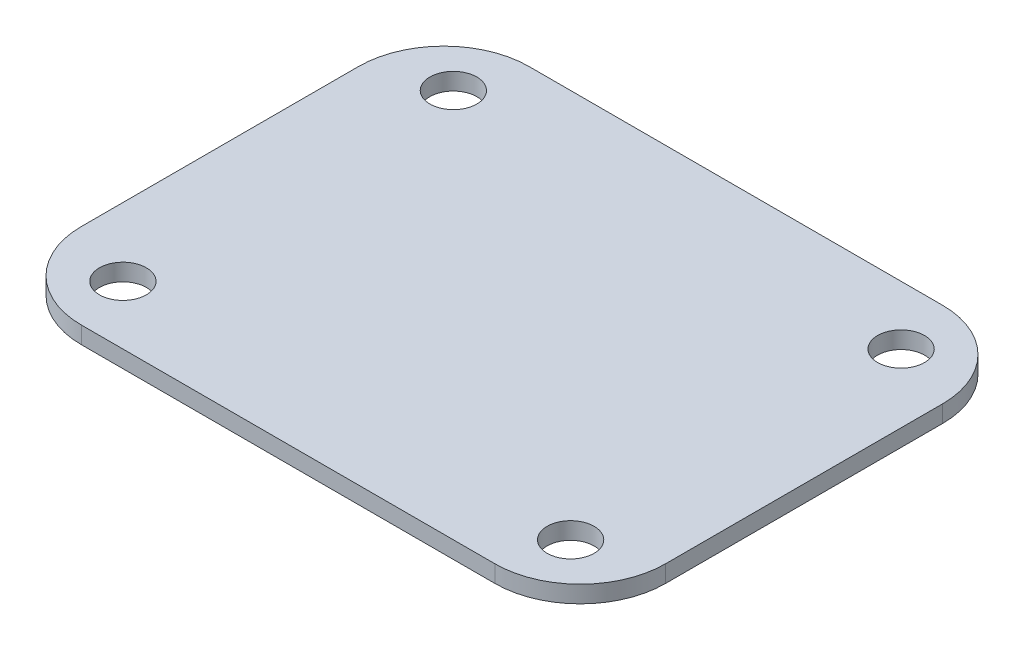
ISO-10303-21;
HEADER;
FILE_DESCRIPTION(('STEP AP214'),'2;1');
FILE_NAME('part.step','',(''),(''),'','','');
FILE_SCHEMA(('AUTOMOTIVE_DESIGN { 1 0 10303 214 1 1 1 1 }'));
ENDSEC;
DATA;
#1=APPLICATION_CONTEXT('core data for automotive mechanical design processes');
#2=APPLICATION_PROTOCOL_DEFINITION('international standard','automotive_design',2000,#1);
#3=PRODUCT_CONTEXT('',#1,'mechanical');
#4=PRODUCT('Part','Part','',(#3));
#5=PRODUCT_RELATED_PRODUCT_CATEGORY('part','',(#4));
#6=PRODUCT_DEFINITION_FORMATION('','',#4);
#7=PRODUCT_DEFINITION_CONTEXT('part definition',#1,'design');
#8=PRODUCT_DEFINITION('design','',#6,#7);
#9=PRODUCT_DEFINITION_SHAPE('','',#8);
#10=(LENGTH_UNIT() NAMED_UNIT(*) SI_UNIT(.MILLI.,.METRE.));
#11=(NAMED_UNIT(*) PLANE_ANGLE_UNIT() SI_UNIT($,.RADIAN.));
#12=(NAMED_UNIT(*) SI_UNIT($,.STERADIAN.) SOLID_ANGLE_UNIT());
#13=UNCERTAINTY_MEASURE_WITH_UNIT(LENGTH_MEASURE(1.E-05),#10,'distance_accuracy_value','');
#14=(GEOMETRIC_REPRESENTATION_CONTEXT(3) GLOBAL_UNCERTAINTY_ASSIGNED_CONTEXT((#13)) GLOBAL_UNIT_ASSIGNED_CONTEXT((#10,
#11,#12)) REPRESENTATION_CONTEXT('',''));
#15=CARTESIAN_POINT('',(0.,0.,0.));
#16=DIRECTION('',(0.,0.,1.));
#17=DIRECTION('',(1.,0.,0.));
#18=AXIS2_PLACEMENT_3D('',#15,#16,#17);
#19=CARTESIAN_POINT('',(-48.5,4.,32.5));
#20=DIRECTION('',(0.,1.,0.));
#21=DIRECTION('',(0.,0.,1.));
#22=AXIS2_PLACEMENT_3D('',#19,#20,#21);
#23=PLANE('',#22);
#24=CARTESIAN_POINT('',(52.5,4.,38.75));
#25=DIRECTION('',(0.,1.,0.));
#26=DIRECTION('',(0.,0.,-1.));
#27=AXIS2_PLACEMENT_3D('',#24,#25,#26);
#28=CIRCLE('',#27,5.5);
#29=CARTESIAN_POINT('',(52.5,4.,33.25));
#30=VERTEX_POINT('',#29);
#31=EDGE_CURVE('E191',#30,#30,#28,.T.);
#32=ORIENTED_EDGE('',*,*,#31,.F.);
#33=EDGE_LOOP('',(#32));
#34=FACE_BOUND('',#33,.T.);
#35=CARTESIAN_POINT('',(52.5,4.,-38.75));
#36=DIRECTION('',(0.,1.,0.));
#37=DIRECTION('',(0.,0.,1.));
#38=AXIS2_PLACEMENT_3D('',#35,#36,#37);
#39=CIRCLE('',#38,5.5);
#40=CARTESIAN_POINT('',(52.5,4.,-33.25));
#41=VERTEX_POINT('',#40);
#42=EDGE_CURVE('E137',#41,#41,#39,.T.);
#43=ORIENTED_EDGE('',*,*,#42,.F.);
#44=EDGE_LOOP('',(#43));
#45=FACE_BOUND('',#44,.T.);
#46=CARTESIAN_POINT('',(-48.5,4.,32.5));
#47=DIRECTION('',(0.,1.,0.));
#48=DIRECTION('',(0.,0.,1.));
#49=AXIS2_PLACEMENT_3D('',#46,#47,#48);
#50=CIRCLE('',#49,20.);
#51=CARTESIAN_POINT('',(-68.5,4.,32.5));
#52=VERTEX_POINT('',#51);
#53=CARTESIAN_POINT('',(-48.5,4.,52.5));
#54=VERTEX_POINT('',#53);
#55=EDGE_CURVE('E148',#52,#54,#50,.T.);
#56=ORIENTED_EDGE('',*,*,#55,.T.);
#57=DIRECTION('',(1.,0.,0.));
#58=VECTOR('',#57,1.);
#59=CARTESIAN_POINT('',(-48.5,4.,52.5));
#60=LINE('',#59,#58);
#61=CARTESIAN_POINT('',(48.5,4.,52.5));
#62=VERTEX_POINT('',#61);
#63=EDGE_CURVE('E96',#54,#62,#60,.T.);
#64=ORIENTED_EDGE('',*,*,#63,.T.);
#65=CARTESIAN_POINT('',(48.5,4.,32.5));
#66=DIRECTION('',(0.,1.,0.));
#67=DIRECTION('',(0.,0.,1.));
#68=AXIS2_PLACEMENT_3D('',#65,#66,#67);
#69=CIRCLE('',#68,20.);
#70=CARTESIAN_POINT('',(68.5,4.,32.5));
#71=VERTEX_POINT('',#70);
#72=EDGE_CURVE('E163',#62,#71,#69,.T.);
#73=ORIENTED_EDGE('',*,*,#72,.T.);
#74=DIRECTION('',(0.,0.,-1.));
#75=VECTOR('',#74,1.);
#76=CARTESIAN_POINT('',(68.5,4.,32.5));
#77=LINE('',#76,#75);
#78=CARTESIAN_POINT('',(68.5,4.,-32.5));
#79=VERTEX_POINT('',#78);
#80=EDGE_CURVE('E176',#71,#79,#77,.T.);
#81=ORIENTED_EDGE('',*,*,#80,.T.);
#82=CARTESIAN_POINT('',(48.5,4.,-32.5));
#83=DIRECTION('',(0.,1.,0.));
#84=DIRECTION('',(0.,0.,1.));
#85=AXIS2_PLACEMENT_3D('',#82,#83,#84);
#86=CIRCLE('',#85,20.);
#87=CARTESIAN_POINT('',(48.5,4.,-52.5));
#88=VERTEX_POINT('',#87);
#89=EDGE_CURVE('E115',#79,#88,#86,.T.);
#90=ORIENTED_EDGE('',*,*,#89,.T.);
#91=DIRECTION('',(-1.,0.,0.));
#92=VECTOR('',#91,1.);
#93=CARTESIAN_POINT('',(48.5,4.,-52.5));
#94=LINE('',#93,#92);
#95=CARTESIAN_POINT('',(-48.5,4.,-52.5));
#96=VERTEX_POINT('',#95);
#97=EDGE_CURVE('E109',#88,#96,#94,.T.);
#98=ORIENTED_EDGE('',*,*,#97,.T.);
#99=CARTESIAN_POINT('',(-48.5,4.,-32.5));
#100=DIRECTION('',(0.,1.,0.));
#101=DIRECTION('',(0.,0.,1.));
#102=AXIS2_PLACEMENT_3D('',#99,#100,#101);
#103=CIRCLE('',#102,20.);
#104=CARTESIAN_POINT('',(-68.5,4.,-32.5));
#105=VERTEX_POINT('',#104);
#106=EDGE_CURVE('E113',#96,#105,#103,.T.);
#107=ORIENTED_EDGE('',*,*,#106,.T.);
#108=DIRECTION('',(0.,0.,1.));
#109=VECTOR('',#108,1.);
#110=CARTESIAN_POINT('',(-68.5,4.,-32.5));
#111=LINE('',#110,#109);
#112=EDGE_CURVE('E53',#105,#52,#111,.T.);
#113=ORIENTED_EDGE('',*,*,#112,.T.);
#114=EDGE_LOOP('',(#56,#64,#73,#81,#90,#98,#107,#113));
#115=FACE_BOUND('',#114,.T.);
#116=CARTESIAN_POINT('',(-52.5,4.,-38.75));
#117=DIRECTION('',(0.,1.,0.));
#118=DIRECTION('',(0.,0.,-1.));
#119=AXIS2_PLACEMENT_3D('',#116,#117,#118);
#120=CIRCLE('',#119,5.5);
#121=CARTESIAN_POINT('',(-52.5,4.,-44.25));
#122=VERTEX_POINT('',#121);
#123=EDGE_CURVE('E185',#122,#122,#120,.T.);
#124=ORIENTED_EDGE('',*,*,#123,.F.);
#125=EDGE_LOOP('',(#124));
#126=FACE_BOUND('',#125,.T.);
#127=CARTESIAN_POINT('',(-52.5,4.,38.75));
#128=DIRECTION('',(0.,1.,0.));
#129=DIRECTION('',(0.,0.,1.));
#130=AXIS2_PLACEMENT_3D('',#127,#128,#129);
#131=CIRCLE('',#130,5.5);
#132=CARTESIAN_POINT('',(-52.5,4.,44.25));
#133=VERTEX_POINT('',#132);
#134=EDGE_CURVE('E197',#133,#133,#131,.T.);
#135=ORIENTED_EDGE('',*,*,#134,.F.);
#136=EDGE_LOOP('',(#135));
#137=FACE_BOUND('',#136,.T.);
#138=ADVANCED_FACE('F36',(#34,#45,#115,#126,#137),#23,.T.);
#139=CARTESIAN_POINT('',(-48.5,0.,32.5));
#140=DIRECTION('',(0.,1.,0.));
#141=DIRECTION('',(0.,0.,1.));
#142=AXIS2_PLACEMENT_3D('',#139,#140,#141);
#143=PLANE('',#142);
#144=CARTESIAN_POINT('',(-48.5,0.,32.5));
#145=DIRECTION('',(0.,1.,0.));
#146=DIRECTION('',(0.,0.,1.));
#147=AXIS2_PLACEMENT_3D('',#144,#145,#146);
#148=CIRCLE('',#147,20.);
#149=CARTESIAN_POINT('',(-68.5,0.,32.5));
#150=VERTEX_POINT('',#149);
#151=CARTESIAN_POINT('',(-48.5,0.,52.5));
#152=VERTEX_POINT('',#151);
#153=EDGE_CURVE('E133',#150,#152,#148,.T.);
#154=ORIENTED_EDGE('',*,*,#153,.F.);
#155=DIRECTION('',(0.,0.,1.));
#156=VECTOR('',#155,1.);
#157=CARTESIAN_POINT('',(-68.5,0.,-32.5));
#158=LINE('',#157,#156);
#159=CARTESIAN_POINT('',(-68.5,0.,-32.5));
#160=VERTEX_POINT('',#159);
#161=EDGE_CURVE('E88',#160,#150,#158,.T.);
#162=ORIENTED_EDGE('',*,*,#161,.F.);
#163=CARTESIAN_POINT('',(-48.5,0.,-32.5));
#164=DIRECTION('',(0.,1.,0.));
#165=DIRECTION('',(0.,0.,1.));
#166=AXIS2_PLACEMENT_3D('',#163,#164,#165);
#167=CIRCLE('',#166,20.);
#168=CARTESIAN_POINT('',(-48.5,0.,-52.5));
#169=VERTEX_POINT('',#168);
#170=EDGE_CURVE('E82',#169,#160,#167,.T.);
#171=ORIENTED_EDGE('',*,*,#170,.F.);
#172=DIRECTION('',(-1.,0.,0.));
#173=VECTOR('',#172,1.);
#174=CARTESIAN_POINT('',(48.5,0.,-52.5));
#175=LINE('',#174,#173);
#176=CARTESIAN_POINT('',(48.5,0.,-52.5));
#177=VERTEX_POINT('',#176);
#178=EDGE_CURVE('E123',#177,#169,#175,.T.);
#179=ORIENTED_EDGE('',*,*,#178,.F.);
#180=CARTESIAN_POINT('',(48.5,0.,-32.5));
#181=DIRECTION('',(0.,1.,0.));
#182=DIRECTION('',(0.,0.,1.));
#183=AXIS2_PLACEMENT_3D('',#180,#181,#182);
#184=CIRCLE('',#183,20.);
#185=CARTESIAN_POINT('',(68.5,0.,-32.5));
#186=VERTEX_POINT('',#185);
#187=EDGE_CURVE('E143',#186,#177,#184,.T.);
#188=ORIENTED_EDGE('',*,*,#187,.F.);
#189=DIRECTION('',(0.,0.,-1.));
#190=VECTOR('',#189,1.);
#191=CARTESIAN_POINT('',(68.5,0.,32.5));
#192=LINE('',#191,#190);
#193=CARTESIAN_POINT('',(68.5,0.,32.5));
#194=VERTEX_POINT('',#193);
#195=EDGE_CURVE('E141',#194,#186,#192,.T.);
#196=ORIENTED_EDGE('',*,*,#195,.F.);
#197=CARTESIAN_POINT('',(48.5,0.,32.5));
#198=DIRECTION('',(0.,1.,0.));
#199=DIRECTION('',(0.,0.,1.));
#200=AXIS2_PLACEMENT_3D('',#197,#198,#199);
#201=CIRCLE('',#200,20.);
#202=CARTESIAN_POINT('',(48.5,0.,52.5));
#203=VERTEX_POINT('',#202);
#204=EDGE_CURVE('E139',#203,#194,#201,.T.);
#205=ORIENTED_EDGE('',*,*,#204,.F.);
#206=DIRECTION('',(1.,0.,0.));
#207=VECTOR('',#206,1.);
#208=CARTESIAN_POINT('',(-48.5,0.,52.5));
#209=LINE('',#208,#207);
#210=EDGE_CURVE('E136',#152,#203,#209,.T.);
#211=ORIENTED_EDGE('',*,*,#210,.F.);
#212=EDGE_LOOP('',(#154,#162,#171,#179,#188,#196,#205,#211));
#213=FACE_BOUND('',#212,.T.);
#214=CARTESIAN_POINT('',(52.5,0.,-38.75));
#215=DIRECTION('',(0.,1.,0.));
#216=DIRECTION('',(0.,0.,1.));
#217=AXIS2_PLACEMENT_3D('',#214,#215,#216);
#218=CIRCLE('',#217,5.5);
#219=CARTESIAN_POINT('',(52.5,0.,-33.25));
#220=VERTEX_POINT('',#219);
#221=EDGE_CURVE('E182',#220,#220,#218,.T.);
#222=ORIENTED_EDGE('',*,*,#221,.T.);
#223=EDGE_LOOP('',(#222));
#224=FACE_BOUND('',#223,.T.);
#225=CARTESIAN_POINT('',(-52.5,0.,-38.75));
#226=DIRECTION('',(0.,1.,0.));
#227=DIRECTION('',(0.,0.,-1.));
#228=AXIS2_PLACEMENT_3D('',#225,#226,#227);
#229=CIRCLE('',#228,5.5);
#230=CARTESIAN_POINT('',(-52.5,0.,-44.25));
#231=VERTEX_POINT('',#230);
#232=EDGE_CURVE('E188',#231,#231,#229,.T.);
#233=ORIENTED_EDGE('',*,*,#232,.T.);
#234=EDGE_LOOP('',(#233));
#235=FACE_BOUND('',#234,.T.);
#236=CARTESIAN_POINT('',(52.5,0.,38.75));
#237=DIRECTION('',(0.,1.,0.));
#238=DIRECTION('',(0.,0.,-1.));
#239=AXIS2_PLACEMENT_3D('',#236,#237,#238);
#240=CIRCLE('',#239,5.5);
#241=CARTESIAN_POINT('',(52.5,0.,33.25));
#242=VERTEX_POINT('',#241);
#243=EDGE_CURVE('E194',#242,#242,#240,.T.);
#244=ORIENTED_EDGE('',*,*,#243,.T.);
#245=EDGE_LOOP('',(#244));
#246=FACE_BOUND('',#245,.T.);
#247=CARTESIAN_POINT('',(-52.5,0.,38.75));
#248=DIRECTION('',(0.,1.,0.));
#249=DIRECTION('',(0.,0.,1.));
#250=AXIS2_PLACEMENT_3D('',#247,#248,#249);
#251=CIRCLE('',#250,5.5);
#252=CARTESIAN_POINT('',(-52.5,0.,44.25));
#253=VERTEX_POINT('',#252);
#254=EDGE_CURVE('E200',#253,#253,#251,.T.);
#255=ORIENTED_EDGE('',*,*,#254,.T.);
#256=EDGE_LOOP('',(#255));
#257=FACE_BOUND('',#256,.T.);
#258=ADVANCED_FACE('F167',(#213,#224,#235,#246,#257),#143,.F.);
#259=CARTESIAN_POINT('',(-48.5,4.,32.5));
#260=DIRECTION('',(0.,-1.,0.));
#261=DIRECTION('',(0.,0.,-1.));
#262=AXIS2_PLACEMENT_3D('',#259,#260,#261);
#263=CYLINDRICAL_SURFACE('',#262,20.);
#264=ORIENTED_EDGE('',*,*,#153,.T.);
#265=DIRECTION('',(0.,-1.,0.));
#266=VECTOR('',#265,1.);
#267=CARTESIAN_POINT('',(-48.5,4.,52.5));
#268=LINE('',#267,#266);
#269=EDGE_CURVE('E11',#54,#152,#268,.T.);
#270=ORIENTED_EDGE('',*,*,#269,.F.);
#271=ORIENTED_EDGE('',*,*,#55,.F.);
#272=DIRECTION('',(0.,-1.,0.));
#273=VECTOR('',#272,1.);
#274=CARTESIAN_POINT('',(-68.5,4.,32.5));
#275=LINE('',#274,#273);
#276=EDGE_CURVE('E129',#52,#150,#275,.T.);
#277=ORIENTED_EDGE('',*,*,#276,.T.);
#278=EDGE_LOOP('',(#264,#270,#271,#277));
#279=FACE_BOUND('',#278,.T.);
#280=ADVANCED_FACE('F38',(#279),#263,.T.);
#281=CARTESIAN_POINT('',(-48.5,4.,52.5));
#282=DIRECTION('',(0.,0.,-1.));
#283=DIRECTION('',(-1.,0.,0.));
#284=AXIS2_PLACEMENT_3D('',#281,#282,#283);
#285=PLANE('',#284);
#286=ORIENTED_EDGE('',*,*,#210,.T.);
#287=DIRECTION('',(0.,-1.,0.));
#288=VECTOR('',#287,1.);
#289=CARTESIAN_POINT('',(48.5,4.,52.5));
#290=LINE('',#289,#288);
#291=EDGE_CURVE('E45',#62,#203,#290,.T.);
#292=ORIENTED_EDGE('',*,*,#291,.F.);
#293=ORIENTED_EDGE('',*,*,#63,.F.);
#294=ORIENTED_EDGE('',*,*,#269,.T.);
#295=EDGE_LOOP('',(#286,#292,#293,#294));
#296=FACE_BOUND('',#295,.T.);
#297=ADVANCED_FACE('F234',(#296),#285,.F.);
#298=CARTESIAN_POINT('',(48.5,4.,32.5));
#299=DIRECTION('',(0.,-1.,0.));
#300=DIRECTION('',(0.,0.,-1.));
#301=AXIS2_PLACEMENT_3D('',#298,#299,#300);
#302=CYLINDRICAL_SURFACE('',#301,20.);
#303=ORIENTED_EDGE('',*,*,#204,.T.);
#304=DIRECTION('',(0.,-1.,0.));
#305=VECTOR('',#304,1.);
#306=CARTESIAN_POINT('',(68.5,4.,32.5));
#307=LINE('',#306,#305);
#308=EDGE_CURVE('E155',#71,#194,#307,.T.);
#309=ORIENTED_EDGE('',*,*,#308,.F.);
#310=ORIENTED_EDGE('',*,*,#72,.F.);
#311=ORIENTED_EDGE('',*,*,#291,.T.);
#312=EDGE_LOOP('',(#303,#309,#310,#311));
#313=FACE_BOUND('',#312,.T.);
#314=ADVANCED_FACE('F161',(#313),#302,.T.);
#315=CARTESIAN_POINT('',(68.5,4.,32.5));
#316=DIRECTION('',(-1.,0.,0.));
#317=DIRECTION('',(0.,0.,1.));
#318=AXIS2_PLACEMENT_3D('',#315,#316,#317);
#319=PLANE('',#318);
#320=ORIENTED_EDGE('',*,*,#195,.T.);
#321=DIRECTION('',(0.,-1.,0.));
#322=VECTOR('',#321,1.);
#323=CARTESIAN_POINT('',(68.5,4.,-32.5));
#324=LINE('',#323,#322);
#325=EDGE_CURVE('E152',#79,#186,#324,.T.);
#326=ORIENTED_EDGE('',*,*,#325,.F.);
#327=ORIENTED_EDGE('',*,*,#80,.F.);
#328=ORIENTED_EDGE('',*,*,#308,.T.);
#329=EDGE_LOOP('',(#320,#326,#327,#328));
#330=FACE_BOUND('',#329,.T.);
#331=ADVANCED_FACE('F172',(#330),#319,.F.);
#332=CARTESIAN_POINT('',(48.5,4.,-32.5));
#333=DIRECTION('',(0.,-1.,0.));
#334=DIRECTION('',(0.,0.,-1.));
#335=AXIS2_PLACEMENT_3D('',#332,#333,#334);
#336=CYLINDRICAL_SURFACE('',#335,20.);
#337=ORIENTED_EDGE('',*,*,#187,.T.);
#338=DIRECTION('',(0.,-1.,0.));
#339=VECTOR('',#338,1.);
#340=CARTESIAN_POINT('',(48.5,4.,-52.5));
#341=LINE('',#340,#339);
#342=EDGE_CURVE('E124',#88,#177,#341,.T.);
#343=ORIENTED_EDGE('',*,*,#342,.F.);
#344=ORIENTED_EDGE('',*,*,#89,.F.);
#345=ORIENTED_EDGE('',*,*,#325,.T.);
#346=EDGE_LOOP('',(#337,#343,#344,#345));
#347=FACE_BOUND('',#346,.T.);
#348=ADVANCED_FACE('F175',(#347),#336,.T.);
#349=CARTESIAN_POINT('',(48.5,4.,-52.5));
#350=DIRECTION('',(0.,0.,1.));
#351=DIRECTION('',(1.,0.,0.));
#352=AXIS2_PLACEMENT_3D('',#349,#350,#351);
#353=PLANE('',#352);
#354=ORIENTED_EDGE('',*,*,#178,.T.);
#355=DIRECTION('',(0.,-1.,0.));
#356=VECTOR('',#355,1.);
#357=CARTESIAN_POINT('',(-48.5,4.,-52.5));
#358=LINE('',#357,#356);
#359=EDGE_CURVE('E120',#96,#169,#358,.T.);
#360=ORIENTED_EDGE('',*,*,#359,.F.);
#361=ORIENTED_EDGE('',*,*,#97,.F.);
#362=ORIENTED_EDGE('',*,*,#342,.T.);
#363=EDGE_LOOP('',(#354,#360,#361,#362));
#364=FACE_BOUND('',#363,.T.);
#365=ADVANCED_FACE('F121',(#364),#353,.F.);
#366=CARTESIAN_POINT('',(-48.5,4.,-32.5));
#367=DIRECTION('',(0.,-1.,0.));
#368=DIRECTION('',(0.,0.,-1.));
#369=AXIS2_PLACEMENT_3D('',#366,#367,#368);
#370=CYLINDRICAL_SURFACE('',#369,20.);
#371=ORIENTED_EDGE('',*,*,#170,.T.);
#372=DIRECTION('',(0.,-1.,0.));
#373=VECTOR('',#372,1.);
#374=CARTESIAN_POINT('',(-68.5,4.,-32.5));
#375=LINE('',#374,#373);
#376=EDGE_CURVE('E125',#105,#160,#375,.T.);
#377=ORIENTED_EDGE('',*,*,#376,.F.);
#378=ORIENTED_EDGE('',*,*,#106,.F.);
#379=ORIENTED_EDGE('',*,*,#359,.T.);
#380=EDGE_LOOP('',(#371,#377,#378,#379));
#381=FACE_BOUND('',#380,.T.);
#382=ADVANCED_FACE('F127',(#381),#370,.T.);
#383=CARTESIAN_POINT('',(-68.5,4.,-32.5));
#384=DIRECTION('',(1.,0.,0.));
#385=DIRECTION('',(0.,0.,-1.));
#386=AXIS2_PLACEMENT_3D('',#383,#384,#385);
#387=PLANE('',#386);
#388=ORIENTED_EDGE('',*,*,#161,.T.);
#389=ORIENTED_EDGE('',*,*,#276,.F.);
#390=ORIENTED_EDGE('',*,*,#112,.F.);
#391=ORIENTED_EDGE('',*,*,#376,.T.);
#392=EDGE_LOOP('',(#388,#389,#390,#391));
#393=FACE_BOUND('',#392,.T.);
#394=ADVANCED_FACE('F222',(#393),#387,.F.);
#395=CARTESIAN_POINT('',(52.5,4.,-38.75));
#396=DIRECTION('',(0.,-1.,0.));
#397=DIRECTION('',(0.,0.,-1.));
#398=AXIS2_PLACEMENT_3D('',#395,#396,#397);
#399=CYLINDRICAL_SURFACE('',#398,5.5);
#400=ORIENTED_EDGE('',*,*,#42,.T.);
#401=EDGE_LOOP('',(#400));
#402=FACE_BOUND('',#401,.T.);
#403=ORIENTED_EDGE('',*,*,#221,.F.);
#404=EDGE_LOOP('',(#403));
#405=FACE_BOUND('',#404,.T.);
#406=ADVANCED_FACE('F219',(#402,#405),#399,.F.);
#407=CARTESIAN_POINT('',(-52.5,4.,-38.75));
#408=DIRECTION('',(0.,-1.,0.));
#409=DIRECTION('',(0.,0.,-1.));
#410=AXIS2_PLACEMENT_3D('',#407,#408,#409);
#411=CYLINDRICAL_SURFACE('',#410,5.5);
#412=ORIENTED_EDGE('',*,*,#123,.T.);
#413=EDGE_LOOP('',(#412));
#414=FACE_BOUND('',#413,.T.);
#415=ORIENTED_EDGE('',*,*,#232,.F.);
#416=EDGE_LOOP('',(#415));
#417=FACE_BOUND('',#416,.T.);
#418=ADVANCED_FACE('F310',(#414,#417),#411,.F.);
#419=CARTESIAN_POINT('',(52.5,4.,38.75));
#420=DIRECTION('',(0.,-1.,0.));
#421=DIRECTION('',(0.,0.,-1.));
#422=AXIS2_PLACEMENT_3D('',#419,#420,#421);
#423=CYLINDRICAL_SURFACE('',#422,5.5);
#424=ORIENTED_EDGE('',*,*,#31,.T.);
#425=EDGE_LOOP('',(#424));
#426=FACE_BOUND('',#425,.T.);
#427=ORIENTED_EDGE('',*,*,#243,.F.);
#428=EDGE_LOOP('',(#427));
#429=FACE_BOUND('',#428,.T.);
#430=ADVANCED_FACE('F319',(#426,#429),#423,.F.);
#431=CARTESIAN_POINT('',(-52.5,4.,38.75));
#432=DIRECTION('',(0.,-1.,0.));
#433=DIRECTION('',(0.,0.,-1.));
#434=AXIS2_PLACEMENT_3D('',#431,#432,#433);
#435=CYLINDRICAL_SURFACE('',#434,5.5);
#436=ORIENTED_EDGE('',*,*,#134,.T.);
#437=EDGE_LOOP('',(#436));
#438=FACE_BOUND('',#437,.T.);
#439=ORIENTED_EDGE('',*,*,#254,.F.);
#440=EDGE_LOOP('',(#439));
#441=FACE_BOUND('',#440,.T.);
#442=ADVANCED_FACE('F206',(#438,#441),#435,.F.);
#443=CLOSED_SHELL('',(#138,#258,#280,#297,#314,#331,#348,#365,#382,#394,#406,#418,#430,#442));
#444=MANIFOLD_SOLID_BREP('B2',#443);
#445=ADVANCED_BREP_SHAPE_REPRESENTATION('',(#18,#444),#14);
#446=SHAPE_DEFINITION_REPRESENTATION(#9,#445);
ENDSEC;
END-ISO-10303-21;
